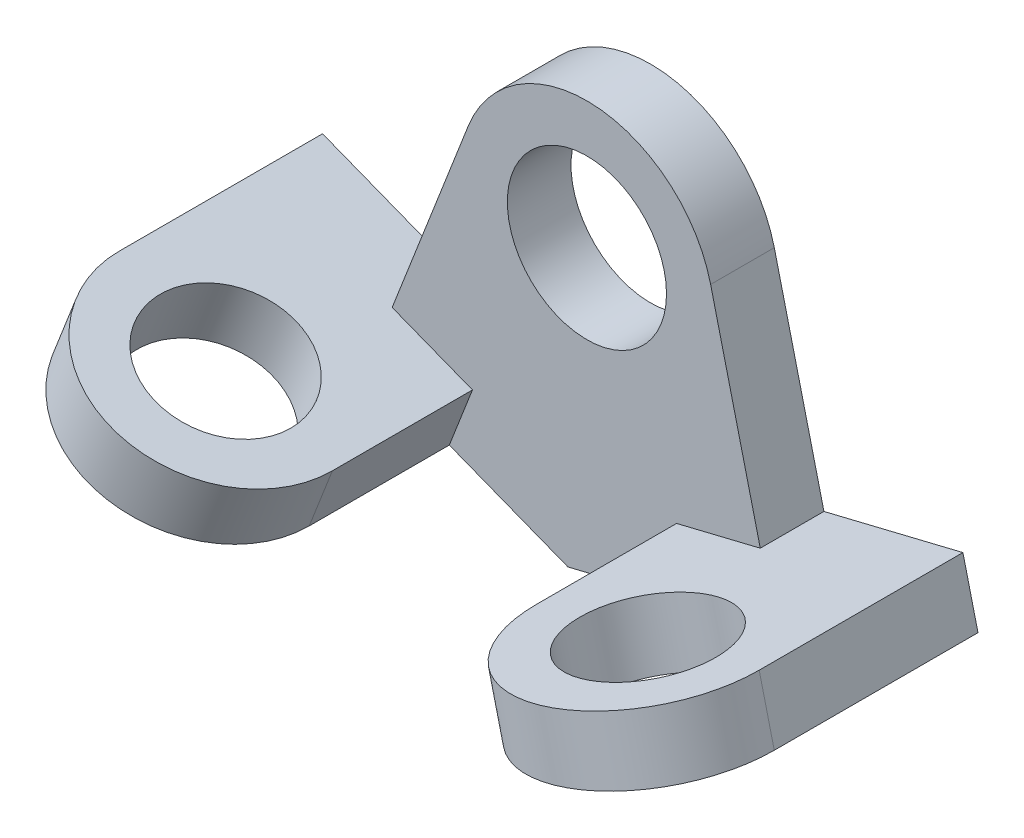
ISO-10303-21;
HEADER;
FILE_DESCRIPTION(('STEP AP214'),'2;1');
FILE_NAME('part.step','',(''),(''),'','','');
FILE_SCHEMA(('AUTOMOTIVE_DESIGN { 1 0 10303 214 1 1 1 1 }'));
ENDSEC;
DATA;
#1=APPLICATION_CONTEXT('core data for automotive mechanical design processes');
#2=APPLICATION_PROTOCOL_DEFINITION('international standard','automotive_design',2000,#1);
#3=PRODUCT_CONTEXT('',#1,'mechanical');
#4=PRODUCT('Part','Part','',(#3));
#5=PRODUCT_RELATED_PRODUCT_CATEGORY('part','',(#4));
#6=PRODUCT_DEFINITION_FORMATION('','',#4);
#7=PRODUCT_DEFINITION_CONTEXT('part definition',#1,'design');
#8=PRODUCT_DEFINITION('design','',#6,#7);
#9=PRODUCT_DEFINITION_SHAPE('','',#8);
#10=(LENGTH_UNIT() NAMED_UNIT(*) SI_UNIT(.MILLI.,.METRE.));
#11=(NAMED_UNIT(*) PLANE_ANGLE_UNIT() SI_UNIT($,.RADIAN.));
#12=(NAMED_UNIT(*) SI_UNIT($,.STERADIAN.) SOLID_ANGLE_UNIT());
#13=UNCERTAINTY_MEASURE_WITH_UNIT(LENGTH_MEASURE(1.E-05),#10,'distance_accuracy_value','');
#14=(GEOMETRIC_REPRESENTATION_CONTEXT(3) GLOBAL_UNCERTAINTY_ASSIGNED_CONTEXT((#13)) GLOBAL_UNIT_ASSIGNED_CONTEXT((#10,
#11,#12)) REPRESENTATION_CONTEXT('',''));
#15=CARTESIAN_POINT('',(0.,0.,0.));
#16=DIRECTION('',(0.,0.,1.));
#17=DIRECTION('',(1.,0.,0.));
#18=AXIS2_PLACEMENT_3D('',#15,#16,#17);
#19=CARTESIAN_POINT('',(-18.6341600347185,7.26416408133096,10.));
#20=DIRECTION('',(-0.931708001735926,0.363208204066548,0.));
#21=DIRECTION('',(-0.363208204066548,-0.931708001735926,0.));
#22=AXIS2_PLACEMENT_3D('',#19,#20,#21);
#23=PLANE('',#22);
#24=DIRECTION('',(0.363208204066548,0.931708001735926,0.));
#25=VECTOR('',#24,1.);
#26=CARTESIAN_POINT('',(-18.6341600347185,7.26416408133096,0.));
#27=LINE('',#26,#25);
#28=CARTESIAN_POINT('',(-30.5899799331622,-23.4051130494594,0.));
#29=VERTEX_POINT('',#28);
#30=CARTESIAN_POINT('',(-18.6341600347185,7.26416408133095,0.));
#31=VERTEX_POINT('',#30);
#32=EDGE_CURVE('E175',#29,#31,#27,.T.);
#33=ORIENTED_EDGE('',*,*,#32,.F.);
#34=DIRECTION('',(0.,0.,1.));
#35=VECTOR('',#34,1.);
#36=CARTESIAN_POINT('',(-30.5899799331622,-23.4051130494594,0.));
#37=LINE('',#36,#35);
#38=CARTESIAN_POINT('',(-30.5899799331622,-23.4051130494594,10.));
#39=VERTEX_POINT('',#38);
#40=EDGE_CURVE('E183',#29,#39,#37,.T.);
#41=ORIENTED_EDGE('',*,*,#40,.T.);
#42=DIRECTION('',(0.363208204066548,0.931708001735926,0.));
#43=VECTOR('',#42,1.);
#44=CARTESIAN_POINT('',(-18.6341600347185,7.26416408133096,10.));
#45=LINE('',#44,#43);
#46=CARTESIAN_POINT('',(-18.6341600347185,7.26416408133095,10.));
#47=VERTEX_POINT('',#46);
#48=EDGE_CURVE('E240',#39,#47,#45,.T.);
#49=ORIENTED_EDGE('',*,*,#48,.T.);
#50=DIRECTION('',(0.,0.,-1.));
#51=VECTOR('',#50,1.);
#52=CARTESIAN_POINT('',(-18.6341600347185,7.26416408133095,10.));
#53=LINE('',#52,#51);
#54=EDGE_CURVE('E81',#47,#31,#53,.T.);
#55=ORIENTED_EDGE('',*,*,#54,.T.);
#56=EDGE_LOOP('',(#33,#41,#49,#55));
#57=FACE_BOUND('',#56,.T.);
#58=ADVANCED_FACE('F73',(#57),#23,.T.);
#59=CARTESIAN_POINT('',(19.430763632887,4.73766024983591,10.));
#60=DIRECTION('',(0.971538181644351,0.236883012491796,0.));
#61=DIRECTION('',(-0.236883012491796,0.971538181644351,0.));
#62=AXIS2_PLACEMENT_3D('',#59,#60,#61);
#63=PLANE('',#62);
#64=DIRECTION('',(0.236883012491796,-0.971538181644351,0.));
#65=VECTOR('',#64,1.);
#66=CARTESIAN_POINT('',(19.430763632887,4.73766024983591,10.));
#67=LINE('',#66,#65);
#68=CARTESIAN_POINT('',(19.430763632887,4.73766024983591,10.));
#69=VERTEX_POINT('',#68);
#70=CARTESIAN_POINT('',(27.2283040040669,-27.2427173797205,10.));
#71=VERTEX_POINT('',#70);
#72=EDGE_CURVE('E206',#69,#71,#67,.T.);
#73=ORIENTED_EDGE('',*,*,#72,.T.);
#74=DIRECTION('',(0.,0.,1.));
#75=VECTOR('',#74,1.);
#76=CARTESIAN_POINT('',(27.2283040040669,-27.2427173797205,0.));
#77=LINE('',#76,#75);
#78=CARTESIAN_POINT('',(27.2283040040669,-27.2427173797205,0.));
#79=VERTEX_POINT('',#78);
#80=EDGE_CURVE('E88',#79,#71,#77,.T.);
#81=ORIENTED_EDGE('',*,*,#80,.F.);
#82=DIRECTION('',(0.236883012491796,-0.971538181644351,0.));
#83=VECTOR('',#82,1.);
#84=CARTESIAN_POINT('',(19.430763632887,4.73766024983591,0.));
#85=LINE('',#84,#83);
#86=CARTESIAN_POINT('',(19.430763632887,4.73766024983591,0.));
#87=VERTEX_POINT('',#86);
#88=EDGE_CURVE('E198',#87,#79,#85,.T.);
#89=ORIENTED_EDGE('',*,*,#88,.F.);
#90=DIRECTION('',(0.,0.,-1.));
#91=VECTOR('',#90,1.);
#92=CARTESIAN_POINT('',(19.430763632887,4.73766024983591,10.));
#93=LINE('',#92,#91);
#94=EDGE_CURVE('E12',#69,#87,#93,.T.);
#95=ORIENTED_EDGE('',*,*,#94,.F.);
#96=EDGE_LOOP('',(#73,#81,#89,#95));
#97=FACE_BOUND('',#96,.T.);
#98=ADVANCED_FACE('F75',(#97),#63,.T.);
#99=CARTESIAN_POINT('',(-15.5879019391089,-39.9863571481489,10.));
#100=DIRECTION('',(-0.363208204066547,-0.931708001735927,0.));
#101=DIRECTION('',(0.931708001735927,-0.363208204066547,0.));
#102=AXIS2_PLACEMENT_3D('',#99,#100,#101);
#103=PLANE('',#102);
#104=DIRECTION('',(0.,0.,-1.));
#105=VECTOR('',#104,1.);
#106=CARTESIAN_POINT('',(-55.155900055827,-24.5615443229889,74.));
#107=LINE('',#106,#105);
#108=CARTESIAN_POINT('',(-55.155900055827,-24.5615443229889,32.));
#109=VERTEX_POINT('',#108);
#110=CARTESIAN_POINT('',(-55.155900055827,-24.5615443229889,0.));
#111=VERTEX_POINT('',#110);
#112=EDGE_CURVE('E261',#109,#111,#107,.T.);
#113=ORIENTED_EDGE('',*,*,#112,.T.);
#114=DIRECTION('',(-0.931708001735927,0.363208204066547,0.));
#115=VECTOR('',#114,1.);
#116=CARTESIAN_POINT('',(-15.5879019391089,-39.9863571481489,0.));
#117=LINE('',#116,#115);
#118=CARTESIAN_POINT('',(-2.98025195861471,-44.9012037507144,0.));
#119=VERTEX_POINT('',#118);
#120=EDGE_CURVE('E193',#119,#111,#117,.T.);
#121=ORIENTED_EDGE('',*,*,#120,.F.);
#122=DIRECTION('',(0.,0.,-1.));
#123=VECTOR('',#122,1.);
#124=CARTESIAN_POINT('',(-2.98025195861471,-44.9012037507144,10.));
#125=LINE('',#124,#123);
#126=CARTESIAN_POINT('',(-2.98025195861471,-44.9012037507144,10.));
#127=VERTEX_POINT('',#126);
#128=EDGE_CURVE('E207',#127,#119,#125,.T.);
#129=ORIENTED_EDGE('',*,*,#128,.F.);
#130=DIRECTION('',(-0.931708001735927,0.363208204066547,0.));
#131=VECTOR('',#130,1.);
#132=CARTESIAN_POINT('',(-15.5879019391089,-39.9863571481489,10.));
#133=LINE('',#132,#131);
#134=CARTESIAN_POINT('',(-21.6144119933334,-37.6370396693839,10.));
#135=VERTEX_POINT('',#134);
#136=EDGE_CURVE('E218',#127,#135,#133,.T.);
#137=ORIENTED_EDGE('',*,*,#136,.T.);
#138=DIRECTION('',(0.,0.,-1.));
#139=VECTOR('',#138,1.);
#140=CARTESIAN_POINT('',(-21.6144119933334,-37.6370396693839,74.));
#141=LINE('',#140,#139);
#142=CARTESIAN_POINT('',(-21.6144119933334,-37.6370396693839,32.));
#143=VERTEX_POINT('',#142);
#144=EDGE_CURVE('E249',#143,#135,#141,.T.);
#145=ORIENTED_EDGE('',*,*,#144,.F.);
#146=CARTESIAN_POINT('',(-38.3851560245799,-31.0992919961856,32.));
#147=DIRECTION('',(-0.363208204066547,-0.931708001735927,0.));
#148=DIRECTION('',(0.931708001735927,-0.363208204066547,0.));
#149=AXIS2_PLACEMENT_3D('',#146,#147,#148);
#150=CIRCLE('',#149,18.);
#151=EDGE_CURVE('E264',#109,#143,#150,.F.);
#152=ORIENTED_EDGE('',*,*,#151,.F.);
#153=EDGE_LOOP('',(#113,#121,#129,#137,#145,#152));
#154=FACE_BOUND('',#153,.T.);
#155=CARTESIAN_POINT('',(-38.3851560245799,-31.0992919961856,32.));
#156=DIRECTION('',(-0.363208204066547,-0.931708001735927,0.));
#157=DIRECTION('',(0.931708001735927,-0.363208204066547,0.));
#158=AXIS2_PLACEMENT_3D('',#155,#156,#157);
#159=CIRCLE('',#158,11.);
#160=CARTESIAN_POINT('',(-28.1363680054847,-35.0945822409177,32.));
#161=VERTEX_POINT('',#160);
#162=EDGE_CURVE('E259',#161,#161,#159,.F.);
#163=ORIENTED_EDGE('',*,*,#162,.T.);
#164=EDGE_LOOP('',(#163));
#165=FACE_BOUND('',#164,.T.);
#166=ADVANCED_FACE('F246',(#154,#165),#103,.T.);
#167=CARTESIAN_POINT('',(-11.9558198984429,-30.6692771307902,74.));
#168=DIRECTION('',(-0.363208204066528,-0.931708001735934,0.));
#169=DIRECTION('',(0.931708001735934,-0.363208204066528,0.));
#170=AXIS2_PLACEMENT_3D('',#167,#168,#169);
#171=PLANE('',#170);
#172=CARTESIAN_POINT('',(-34.7530739839149,-21.782211978827,32.));
#173=DIRECTION('',(-0.363208204066528,-0.931708001735934,0.));
#174=DIRECTION('',(0.931708001735934,-0.363208204066528,0.));
#175=AXIS2_PLACEMENT_3D('',#172,#173,#174);
#176=CIRCLE('',#175,11.);
#177=CARTESIAN_POINT('',(-24.5042859648197,-25.7775022235588,32.));
#178=VERTEX_POINT('',#177);
#179=EDGE_CURVE('E367',#178,#178,#176,.T.);
#180=ORIENTED_EDGE('',*,*,#179,.T.);
#181=EDGE_LOOP('',(#180));
#182=FACE_BOUND('',#181,.T.);
#183=DIRECTION('',(0.,0.,-1.));
#184=VECTOR('',#183,1.);
#185=CARTESIAN_POINT('',(-51.5238180151617,-15.2444643056295,74.));
#186=LINE('',#185,#184);
#187=CARTESIAN_POINT('',(-51.5238180151617,-15.2444643056295,32.));
#188=VERTEX_POINT('',#187);
#189=CARTESIAN_POINT('',(-51.5238180151617,-15.2444643056295,0.));
#190=VERTEX_POINT('',#189);
#191=EDGE_CURVE('E269',#188,#190,#186,.T.);
#192=ORIENTED_EDGE('',*,*,#191,.F.);
#193=CARTESIAN_POINT('',(-34.7530739839149,-21.782211978827,32.));
#194=DIRECTION('',(-0.363208204066528,-0.931708001735934,0.));
#195=DIRECTION('',(0.931708001735934,-0.363208204066528,0.));
#196=AXIS2_PLACEMENT_3D('',#193,#194,#195);
#197=CIRCLE('',#196,18.);
#198=CARTESIAN_POINT('',(-17.9823299526681,-28.3199596520245,32.));
#199=VERTEX_POINT('',#198);
#200=EDGE_CURVE('E96',#199,#188,#197,.T.);
#201=ORIENTED_EDGE('',*,*,#200,.F.);
#202=DIRECTION('',(0.,0.,-1.));
#203=VECTOR('',#202,1.);
#204=CARTESIAN_POINT('',(-17.9823299526681,-28.3199596520246,74.));
#205=LINE('',#204,#203);
#206=CARTESIAN_POINT('',(-17.9823299526681,-28.3199596520246,10.));
#207=VERTEX_POINT('',#206);
#208=EDGE_CURVE('E271',#199,#207,#205,.T.);
#209=ORIENTED_EDGE('',*,*,#208,.T.);
#210=DIRECTION('',(-0.931708001735934,0.363208204066528,0.));
#211=VECTOR('',#210,1.);
#212=CARTESIAN_POINT('',(-11.9558198984429,-30.6692771307902,10.));
#213=LINE('',#212,#211);
#214=EDGE_CURVE('E186',#207,#39,#213,.T.);
#215=ORIENTED_EDGE('',*,*,#214,.T.);
#216=ORIENTED_EDGE('',*,*,#40,.F.);
#217=DIRECTION('',(0.931708001735934,-0.363208204066528,0.));
#218=VECTOR('',#217,1.);
#219=CARTESIAN_POINT('',(-51.5238180151617,-15.2444643056295,0.));
#220=LINE('',#219,#218);
#221=EDGE_CURVE('E169',#190,#29,#220,.T.);
#222=ORIENTED_EDGE('',*,*,#221,.F.);
#223=EDGE_LOOP('',(#192,#201,#209,#215,#216,#222));
#224=FACE_BOUND('',#223,.T.);
#225=ADVANCED_FACE('F184',(#182,#224),#171,.F.);
#226=CARTESIAN_POINT('',(-39.5679981167188,15.4248128251606,74.));
#227=DIRECTION('',(0.931708001735934,-0.363208204066528,0.));
#228=DIRECTION('',(0.363208204066528,0.931708001735934,0.));
#229=AXIS2_PLACEMENT_3D('',#226,#227,#228);
#230=PLANE('',#229);
#231=DIRECTION('',(0.363208204066528,0.931708001735934,0.));
#232=VECTOR('',#231,1.);
#233=CARTESIAN_POINT('',(-74.7691430754195,-74.8737764167294,32.));
#234=LINE('',#233,#232);
#235=EDGE_CURVE('E365',#109,#188,#234,.T.);
#236=ORIENTED_EDGE('',*,*,#235,.T.);
#237=ORIENTED_EDGE('',*,*,#191,.T.);
#238=DIRECTION('',(0.363208204066528,0.931708001735934,0.));
#239=VECTOR('',#238,1.);
#240=CARTESIAN_POINT('',(-55.155900055827,-24.5615443229889,0.));
#241=LINE('',#240,#239);
#242=EDGE_CURVE('E178',#111,#190,#241,.T.);
#243=ORIENTED_EDGE('',*,*,#242,.F.);
#244=ORIENTED_EDGE('',*,*,#112,.F.);
#245=EDGE_LOOP('',(#236,#237,#243,#244));
#246=FACE_BOUND('',#245,.T.);
#247=ADVANCED_FACE('F331',(#246),#230,.F.);
#248=CARTESIAN_POINT('',(0.,0.,10.));
#249=DIRECTION('',(0.,0.,1.));
#250=DIRECTION('',(1.,0.,0.));
#251=AXIS2_PLACEMENT_3D('',#248,#249,#250);
#252=PLANE('',#251);
#253=CARTESIAN_POINT('',(0.,0.,10.));
#254=DIRECTION('',(0.,0.,1.));
#255=DIRECTION('',(1.,0.,0.));
#256=AXIS2_PLACEMENT_3D('',#253,#254,#255);
#257=CIRCLE('',#256,12.5);
#258=CARTESIAN_POINT('',(12.5,0.,10.));
#259=VERTEX_POINT('',#258);
#260=EDGE_CURVE('E208',#259,#259,#257,.T.);
#261=ORIENTED_EDGE('',*,*,#260,.F.);
#262=EDGE_LOOP('',(#261));
#263=FACE_BOUND('',#262,.T.);
#264=ORIENTED_EDGE('',*,*,#214,.F.);
#265=DIRECTION('',(0.363208204066529,0.931708001735934,0.));
#266=VECTOR('',#265,1.);
#267=CARTESIAN_POINT('',(-6.0265100542252,2.34931747876561,10.));
#268=LINE('',#267,#266);
#269=EDGE_CURVE('E256',#135,#207,#268,.T.);
#270=ORIENTED_EDGE('',*,*,#269,.F.);
#271=ORIENTED_EDGE('',*,*,#136,.F.);
#272=DIRECTION('',(0.971538181644351,0.236883012491796,0.));
#273=VECTOR('',#272,1.);
#274=CARTESIAN_POINT('',(10.1663704960979,-41.6957594459999,10.));
#275=LINE('',#274,#273);
#276=CARTESIAN_POINT('',(16.4505116742723,-40.1635435008785,10.));
#277=VERTEX_POINT('',#276);
#278=EDGE_CURVE('E213',#127,#277,#275,.T.);
#279=ORIENTED_EDGE('',*,*,#278,.T.);
#280=DIRECTION('',(-0.236883012491797,0.971538181644351,0.));
#281=VECTOR('',#280,1.);
#282=CARTESIAN_POINT('',(6.28414117817438,1.53221594512137,10.));
#283=LINE('',#282,#281);
#284=CARTESIAN_POINT('',(14.0816815493543,-30.448161684435,10.));
#285=VERTEX_POINT('',#284);
#286=EDGE_CURVE('E292',#277,#285,#283,.T.);
#287=ORIENTED_EDGE('',*,*,#286,.T.);
#288=DIRECTION('',(0.971538181644351,0.236883012491796,0.));
#289=VECTOR('',#288,1.);
#290=CARTESIAN_POINT('',(7.79754037117994,-31.9803776295564,10.));
#291=LINE('',#290,#289);
#292=EDGE_CURVE('E290',#285,#71,#291,.T.);
#293=ORIENTED_EDGE('',*,*,#292,.T.);
#294=ORIENTED_EDGE('',*,*,#72,.F.);
#295=CARTESIAN_POINT('',(0.,0.,10.));
#296=DIRECTION('',(0.,0.,1.));
#297=DIRECTION('',(1.,0.,0.));
#298=AXIS2_PLACEMENT_3D('',#295,#296,#297);
#299=CIRCLE('',#298,20.);
#300=EDGE_CURVE('E237',#69,#47,#299,.T.);
#301=ORIENTED_EDGE('',*,*,#300,.T.);
#302=ORIENTED_EDGE('',*,*,#48,.F.);
#303=EDGE_LOOP('',(#264,#270,#271,#279,#287,#293,#294,#301,#302));
#304=FACE_BOUND('',#303,.T.);
#305=ADVANCED_FACE('F253',(#263,#304),#252,.T.);
#306=CARTESIAN_POINT('',(10.1663704960979,-41.6957594459999,10.));
#307=DIRECTION('',(-0.236883012491796,0.971538181644351,0.));
#308=DIRECTION('',(-0.971538181644351,-0.236883012491796,0.));
#309=AXIS2_PLACEMENT_3D('',#306,#307,#308);
#310=PLANE('',#309);
#311=DIRECTION('',(0.971538181644351,0.236883012491796,0.));
#312=VECTOR('',#311,1.);
#313=CARTESIAN_POINT('',(10.1663704960979,-41.6957594459999,0.));
#314=LINE('',#313,#312);
#315=CARTESIAN_POINT('',(51.4258862134689,-31.6357550511739,0.));
#316=VERTEX_POINT('',#315);
#317=EDGE_CURVE('E196',#119,#316,#314,.T.);
#318=ORIENTED_EDGE('',*,*,#317,.T.);
#319=DIRECTION('',(0.,0.,-1.));
#320=VECTOR('',#319,1.);
#321=CARTESIAN_POINT('',(51.4258862134689,-31.6357550511739,74.));
#322=LINE('',#321,#320);
#323=CARTESIAN_POINT('',(51.4258862134689,-31.6357550511738,32.));
#324=VERTEX_POINT('',#323);
#325=EDGE_CURVE('E221',#324,#316,#322,.T.);
#326=ORIENTED_EDGE('',*,*,#325,.F.);
#327=CARTESIAN_POINT('',(33.9381989438706,-35.8996492760262,32.));
#328=DIRECTION('',(-0.236883012491796,0.971538181644351,0.));
#329=DIRECTION('',(-0.971538181644351,-0.236883012491796,0.));
#330=AXIS2_PLACEMENT_3D('',#327,#328,#329);
#331=CIRCLE('',#330,18.);
#332=CARTESIAN_POINT('',(16.4505116742723,-40.1635435008785,32.));
#333=VERTEX_POINT('',#332);
#334=EDGE_CURVE('E285',#333,#324,#331,.T.);
#335=ORIENTED_EDGE('',*,*,#334,.F.);
#336=DIRECTION('',(0.,0.,-1.));
#337=VECTOR('',#336,1.);
#338=CARTESIAN_POINT('',(16.4505116742723,-40.1635435008785,74.));
#339=LINE('',#338,#337);
#340=EDGE_CURVE('E294',#333,#277,#339,.T.);
#341=ORIENTED_EDGE('',*,*,#340,.T.);
#342=ORIENTED_EDGE('',*,*,#278,.F.);
#343=ORIENTED_EDGE('',*,*,#128,.T.);
#344=EDGE_LOOP('',(#318,#326,#335,#341,#342,#343));
#345=FACE_BOUND('',#344,.T.);
#346=CARTESIAN_POINT('',(33.9381989438706,-35.8996492760262,32.));
#347=DIRECTION('',(-0.236883012491796,0.971538181644351,0.));
#348=DIRECTION('',(-0.971538181644351,-0.236883012491796,0.));
#349=AXIS2_PLACEMENT_3D('',#346,#347,#348);
#350=CIRCLE('',#349,11.);
#351=CARTESIAN_POINT('',(23.2512789457828,-38.5053624134359,32.));
#352=VERTEX_POINT('',#351);
#353=EDGE_CURVE('E287',#352,#352,#350,.T.);
#354=ORIENTED_EDGE('',*,*,#353,.T.);
#355=EDGE_LOOP('',(#354));
#356=FACE_BOUND('',#355,.T.);
#357=ADVANCED_FACE('F323',(#345,#356),#310,.F.);
#358=CARTESIAN_POINT('',(7.79754037117994,-31.9803776295564,74.));
#359=DIRECTION('',(-0.236883012491796,0.971538181644351,0.));
#360=DIRECTION('',(-0.971538181644351,-0.236883012491796,0.));
#361=AXIS2_PLACEMENT_3D('',#358,#359,#360);
#362=PLANE('',#361);
#363=CARTESIAN_POINT('',(31.5693688189527,-26.1842674595827,32.));
#364=DIRECTION('',(-0.236883012491797,0.971538181644351,0.));
#365=DIRECTION('',(-0.971538181644351,-0.236883012491797,0.));
#366=AXIS2_PLACEMENT_3D('',#363,#364,#365);
#367=CIRCLE('',#366,11.);
#368=CARTESIAN_POINT('',(20.8824488208648,-28.7899805969924,32.));
#369=VERTEX_POINT('',#368);
#370=EDGE_CURVE('E280',#369,#369,#367,.T.);
#371=ORIENTED_EDGE('',*,*,#370,.F.);
#372=EDGE_LOOP('',(#371));
#373=FACE_BOUND('',#372,.T.);
#374=DIRECTION('',(0.,0.,-1.));
#375=VECTOR('',#374,1.);
#376=CARTESIAN_POINT('',(14.0816815493543,-30.448161684435,74.));
#377=LINE('',#376,#375);
#378=CARTESIAN_POINT('',(14.0816815493543,-30.448161684435,32.));
#379=VERTEX_POINT('',#378);
#380=EDGE_CURVE('E232',#379,#285,#377,.T.);
#381=ORIENTED_EDGE('',*,*,#380,.F.);
#382=CARTESIAN_POINT('',(31.5693688189527,-26.1842674595827,32.));
#383=DIRECTION('',(-0.236883012491797,0.971538181644351,0.));
#384=DIRECTION('',(-0.971538181644351,-0.236883012491797,0.));
#385=AXIS2_PLACEMENT_3D('',#382,#383,#384);
#386=CIRCLE('',#385,18.);
#387=CARTESIAN_POINT('',(49.0570560885509,-21.9203732347303,32.));
#388=VERTEX_POINT('',#387);
#389=EDGE_CURVE('E274',#379,#388,#386,.T.);
#390=ORIENTED_EDGE('',*,*,#389,.T.);
#391=DIRECTION('',(0.,0.,-1.));
#392=VECTOR('',#391,1.);
#393=CARTESIAN_POINT('',(49.057056088551,-21.9203732347303,74.));
#394=LINE('',#393,#392);
#395=CARTESIAN_POINT('',(49.057056088551,-21.9203732347303,0.));
#396=VERTEX_POINT('',#395);
#397=EDGE_CURVE('E225',#388,#396,#394,.T.);
#398=ORIENTED_EDGE('',*,*,#397,.T.);
#399=DIRECTION('',(0.971538181644351,0.236883012491797,0.));
#400=VECTOR('',#399,1.);
#401=CARTESIAN_POINT('',(27.2283040040669,-27.2427173797205,0.));
#402=LINE('',#401,#400);
#403=EDGE_CURVE('E189',#79,#396,#402,.T.);
#404=ORIENTED_EDGE('',*,*,#403,.F.);
#405=ORIENTED_EDGE('',*,*,#80,.T.);
#406=ORIENTED_EDGE('',*,*,#292,.F.);
#407=EDGE_LOOP('',(#381,#390,#398,#404,#405,#406));
#408=FACE_BOUND('',#407,.T.);
#409=ADVANCED_FACE('F302',(#373,#408),#362,.T.);
#410=CARTESIAN_POINT('',(6.28414117817438,1.53221594512137,74.));
#411=DIRECTION('',(-0.971538181644351,-0.236883012491797,0.));
#412=DIRECTION('',(0.236883012491797,-0.971538181644351,0.));
#413=AXIS2_PLACEMENT_3D('',#410,#411,#412);
#414=PLANE('',#413);
#415=ORIENTED_EDGE('',*,*,#340,.F.);
#416=DIRECTION('',(-0.236883012491796,0.971538181644351,0.));
#417=VECTOR('',#416,1.);
#418=CARTESIAN_POINT('',(29.2421943488293,-92.6266053096735,32.));
#419=LINE('',#418,#417);
#420=EDGE_CURVE('E277',#333,#379,#419,.T.);
#421=ORIENTED_EDGE('',*,*,#420,.T.);
#422=ORIENTED_EDGE('',*,*,#380,.T.);
#423=ORIENTED_EDGE('',*,*,#286,.F.);
#424=EDGE_LOOP('',(#415,#421,#422,#423));
#425=FACE_BOUND('',#424,.T.);
#426=ADVANCED_FACE('F300',(#425),#414,.T.);
#427=CARTESIAN_POINT('',(0.,0.,10.));
#428=DIRECTION('',(0.,0.,-1.));
#429=DIRECTION('',(-1.,0.,0.));
#430=AXIS2_PLACEMENT_3D('',#427,#428,#429);
#431=CYLINDRICAL_SURFACE('',#430,20.);
#432=CARTESIAN_POINT('',(0.,0.,0.));
#433=DIRECTION('',(0.,0.,1.));
#434=DIRECTION('',(1.,0.,0.));
#435=AXIS2_PLACEMENT_3D('',#432,#433,#434);
#436=CIRCLE('',#435,20.);
#437=EDGE_CURVE('E194',#87,#31,#436,.T.);
#438=ORIENTED_EDGE('',*,*,#437,.T.);
#439=ORIENTED_EDGE('',*,*,#54,.F.);
#440=ORIENTED_EDGE('',*,*,#300,.F.);
#441=ORIENTED_EDGE('',*,*,#94,.T.);
#442=EDGE_LOOP('',(#438,#439,#440,#441));
#443=FACE_BOUND('',#442,.T.);
#444=ADVANCED_FACE('F306',(#443),#431,.T.);
#445=CARTESIAN_POINT('',(0.,0.,10.));
#446=DIRECTION('',(0.,0.,-1.));
#447=DIRECTION('',(-1.,0.,0.));
#448=AXIS2_PLACEMENT_3D('',#445,#446,#447);
#449=CYLINDRICAL_SURFACE('',#448,12.5);
#450=ORIENTED_EDGE('',*,*,#260,.T.);
#451=EDGE_LOOP('',(#450));
#452=FACE_BOUND('',#451,.T.);
#453=CARTESIAN_POINT('',(0.,0.,0.));
#454=DIRECTION('',(0.,0.,1.));
#455=DIRECTION('',(1.,0.,0.));
#456=AXIS2_PLACEMENT_3D('',#453,#454,#455);
#457=CIRCLE('',#456,12.5);
#458=CARTESIAN_POINT('',(12.5,0.,0.));
#459=VERTEX_POINT('',#458);
#460=EDGE_CURVE('E203',#459,#459,#457,.T.);
#461=ORIENTED_EDGE('',*,*,#460,.F.);
#462=EDGE_LOOP('',(#461));
#463=FACE_BOUND('',#462,.T.);
#464=ADVANCED_FACE('F308',(#452,#463),#449,.F.);
#465=CARTESIAN_POINT('',(0.,0.,0.));
#466=DIRECTION('',(0.,0.,1.));
#467=DIRECTION('',(1.,0.,0.));
#468=AXIS2_PLACEMENT_3D('',#465,#466,#467);
#469=PLANE('',#468);
#470=ORIENTED_EDGE('',*,*,#88,.T.);
#471=ORIENTED_EDGE('',*,*,#403,.T.);
#472=DIRECTION('',(0.236883012491797,-0.971538181644351,0.));
#473=VECTOR('',#472,1.);
#474=CARTESIAN_POINT('',(49.057056088551,-21.9203732347303,0.));
#475=LINE('',#474,#473);
#476=EDGE_CURVE('E375',#396,#316,#475,.T.);
#477=ORIENTED_EDGE('',*,*,#476,.T.);
#478=ORIENTED_EDGE('',*,*,#317,.F.);
#479=ORIENTED_EDGE('',*,*,#120,.T.);
#480=ORIENTED_EDGE('',*,*,#242,.T.);
#481=ORIENTED_EDGE('',*,*,#221,.T.);
#482=ORIENTED_EDGE('',*,*,#32,.T.);
#483=ORIENTED_EDGE('',*,*,#437,.F.);
#484=EDGE_LOOP('',(#470,#471,#477,#478,#479,#480,#481,#482,#483));
#485=FACE_BOUND('',#484,.T.);
#486=ORIENTED_EDGE('',*,*,#460,.T.);
#487=EDGE_LOOP('',(#486));
#488=FACE_BOUND('',#487,.T.);
#489=ADVANCED_FACE('F171',(#485,#488),#469,.F.);
#490=CARTESIAN_POINT('',(41.259515717371,10.0600043948261,74.));
#491=DIRECTION('',(0.971538181644351,0.236883012491797,0.));
#492=DIRECTION('',(-0.236883012491797,0.971538181644351,0.));
#493=AXIS2_PLACEMENT_3D('',#490,#491,#492);
#494=PLANE('',#493);
#495=DIRECTION('',(-0.236883012491796,0.971538181644351,0.));
#496=VECTOR('',#495,1.);
#497=CARTESIAN_POINT('',(64.2175688880259,-84.0988168599688,32.));
#498=LINE('',#497,#496);
#499=EDGE_CURVE('E278',#324,#388,#498,.T.);
#500=ORIENTED_EDGE('',*,*,#499,.F.);
#501=ORIENTED_EDGE('',*,*,#325,.T.);
#502=ORIENTED_EDGE('',*,*,#476,.F.);
#503=ORIENTED_EDGE('',*,*,#397,.F.);
#504=EDGE_LOOP('',(#500,#501,#502,#503));
#505=FACE_BOUND('',#504,.T.);
#506=ADVANCED_FACE('F328',(#505),#494,.T.);
#507=CARTESIAN_POINT('',(46.7298816184276,-88.3627110848212,32.));
#508=DIRECTION('',(-0.236883012491796,0.971538181644351,0.));
#509=DIRECTION('',(-0.971538181644351,-0.236883012491796,0.));
#510=AXIS2_PLACEMENT_3D('',#507,#508,#509);
#511=CYLINDRICAL_SURFACE('',#510,18.);
#512=ORIENTED_EDGE('',*,*,#334,.T.);
#513=ORIENTED_EDGE('',*,*,#499,.T.);
#514=ORIENTED_EDGE('',*,*,#389,.F.);
#515=ORIENTED_EDGE('',*,*,#420,.F.);
#516=EDGE_LOOP('',(#512,#513,#514,#515));
#517=FACE_BOUND('',#516,.T.);
#518=ADVANCED_FACE('F335',(#517),#511,.T.);
#519=CARTESIAN_POINT('',(46.7298816184276,-88.3627110848212,32.));
#520=DIRECTION('',(-0.236883012491796,0.971538181644351,0.));
#521=DIRECTION('',(-0.971538181644351,-0.236883012491796,0.));
#522=AXIS2_PLACEMENT_3D('',#519,#520,#521);
#523=CYLINDRICAL_SURFACE('',#522,11.);
#524=ORIENTED_EDGE('',*,*,#370,.T.);
#525=EDGE_LOOP('',(#524));
#526=FACE_BOUND('',#525,.T.);
#527=ORIENTED_EDGE('',*,*,#353,.F.);
#528=EDGE_LOOP('',(#527));
#529=FACE_BOUND('',#528,.T.);
#530=ADVANCED_FACE('F339',(#526,#529),#523,.F.);
#531=CARTESIAN_POINT('',(-6.0265100542252,2.34931747876561,74.));
#532=DIRECTION('',(-0.931708001735934,0.363208204066529,0.));
#533=DIRECTION('',(-0.363208204066529,-0.931708001735934,0.));
#534=AXIS2_PLACEMENT_3D('',#531,#532,#533);
#535=PLANE('',#534);
#536=ORIENTED_EDGE('',*,*,#208,.F.);
#537=DIRECTION('',(0.363208204066528,0.931708001735934,0.));
#538=VECTOR('',#537,1.);
#539=CARTESIAN_POINT('',(-41.2276550129259,-87.9492717631244,32.));
#540=LINE('',#539,#538);
#541=EDGE_CURVE('E364',#143,#199,#540,.T.);
#542=ORIENTED_EDGE('',*,*,#541,.F.);
#543=ORIENTED_EDGE('',*,*,#144,.T.);
#544=ORIENTED_EDGE('',*,*,#269,.T.);
#545=EDGE_LOOP('',(#536,#542,#543,#544));
#546=FACE_BOUND('',#545,.T.);
#547=ADVANCED_FACE('F342',(#546),#535,.F.);
#548=CARTESIAN_POINT('',(-57.9983990441728,-81.4115240899269,32.));
#549=DIRECTION('',(0.363208204066528,0.931708001735934,0.));
#550=DIRECTION('',(-0.931708001735934,0.363208204066528,0.));
#551=AXIS2_PLACEMENT_3D('',#548,#549,#550);
#552=CYLINDRICAL_SURFACE('',#551,18.);
#553=ORIENTED_EDGE('',*,*,#151,.T.);
#554=ORIENTED_EDGE('',*,*,#541,.T.);
#555=ORIENTED_EDGE('',*,*,#200,.T.);
#556=ORIENTED_EDGE('',*,*,#235,.F.);
#557=EDGE_LOOP('',(#553,#554,#555,#556));
#558=FACE_BOUND('',#557,.T.);
#559=ADVANCED_FACE('F349',(#558),#552,.T.);
#560=CARTESIAN_POINT('',(-57.9983990441728,-81.4115240899269,32.));
#561=DIRECTION('',(0.363208204066528,0.931708001735934,0.));
#562=DIRECTION('',(-0.931708001735934,0.363208204066528,0.));
#563=AXIS2_PLACEMENT_3D('',#560,#561,#562);
#564=CYLINDRICAL_SURFACE('',#563,11.);
#565=ORIENTED_EDGE('',*,*,#162,.F.);
#566=EDGE_LOOP('',(#565));
#567=FACE_BOUND('',#566,.T.);
#568=ORIENTED_EDGE('',*,*,#179,.F.);
#569=EDGE_LOOP('',(#568));
#570=FACE_BOUND('',#569,.T.);
#571=ADVANCED_FACE('F356',(#567,#570),#564,.F.);
#572=CLOSED_SHELL('',(#58,#98,#166,#225,#247,#305,#357,#409,#426,#444,#464,#489,#506,#518,#530,
#547,#559,#571));
#573=MANIFOLD_SOLID_BREP('B2',#572);
#574=ADVANCED_BREP_SHAPE_REPRESENTATION('',(#18,#573),#14);
#575=SHAPE_DEFINITION_REPRESENTATION(#9,#574);
ENDSEC;
END-ISO-10303-21;
